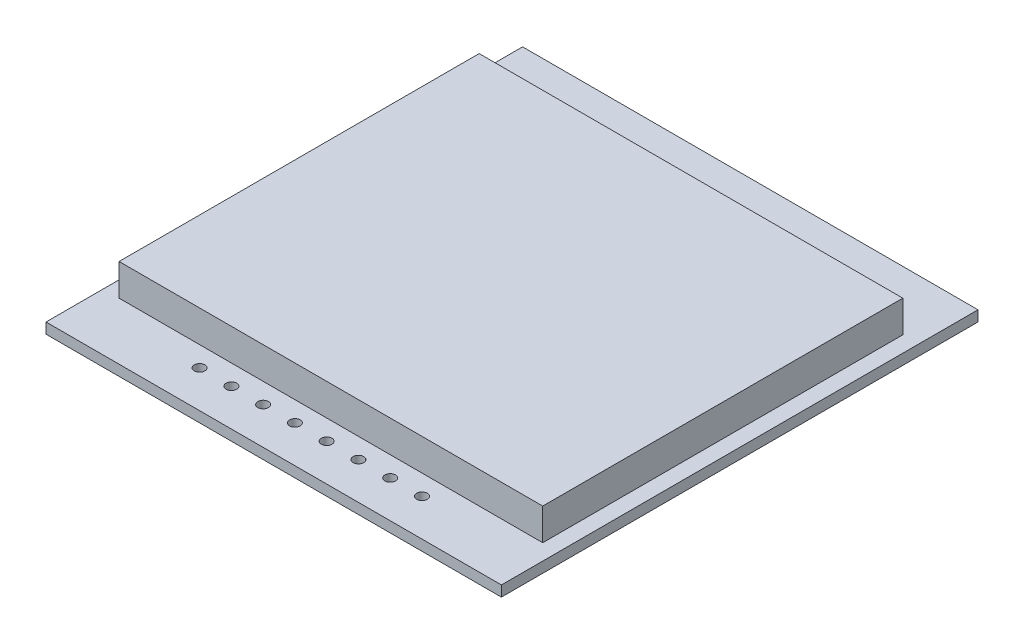
ISO-10303-21;
HEADER;
FILE_DESCRIPTION(('STEP AP214'),'2;1');
FILE_NAME('part.step','',(''),(''),'','','');
FILE_SCHEMA(('AUTOMOTIVE_DESIGN { 1 0 10303 214 1 1 1 1 }'));
ENDSEC;
DATA;
#1=APPLICATION_CONTEXT('core data for automotive mechanical design processes');
#2=APPLICATION_PROTOCOL_DEFINITION('international standard','automotive_design',2000,#1);
#3=PRODUCT_CONTEXT('',#1,'mechanical');
#4=PRODUCT('Part','Part','',(#3));
#5=PRODUCT_RELATED_PRODUCT_CATEGORY('part','',(#4));
#6=PRODUCT_DEFINITION_FORMATION('','',#4);
#7=PRODUCT_DEFINITION_CONTEXT('part definition',#1,'design');
#8=PRODUCT_DEFINITION('design','',#6,#7);
#9=PRODUCT_DEFINITION_SHAPE('','',#8);
#10=(LENGTH_UNIT() NAMED_UNIT(*) SI_UNIT(.MILLI.,.METRE.));
#11=(NAMED_UNIT(*) PLANE_ANGLE_UNIT() SI_UNIT($,.RADIAN.));
#12=(NAMED_UNIT(*) SI_UNIT($,.STERADIAN.) SOLID_ANGLE_UNIT());
#13=UNCERTAINTY_MEASURE_WITH_UNIT(LENGTH_MEASURE(1.E-05),#10,'distance_accuracy_value','');
#14=(GEOMETRIC_REPRESENTATION_CONTEXT(3) GLOBAL_UNCERTAINTY_ASSIGNED_CONTEXT((#13)) GLOBAL_UNIT_ASSIGNED_CONTEXT((#10,
#11,#12)) REPRESENTATION_CONTEXT('',''));
#15=CARTESIAN_POINT('',(0.,0.,0.));
#16=DIRECTION('',(0.,0.,1.));
#17=DIRECTION('',(1.,0.,0.));
#18=AXIS2_PLACEMENT_3D('',#15,#16,#17);
#19=CARTESIAN_POINT('',(0.,1.,0.));
#20=DIRECTION('',(0.,-1.,0.));
#21=DIRECTION('',(0.,0.,-1.));
#22=AXIS2_PLACEMENT_3D('',#19,#20,#21);
#23=PLANE('',#22);
#24=CARTESIAN_POINT('',(-1.5,1.,19.));
#25=DIRECTION('',(0.,1.,0.));
#26=DIRECTION('',(0.,0.,-1.));
#27=AXIS2_PLACEMENT_3D('',#24,#25,#26);
#28=CIRCLE('',#27,0.500000000000001);
#29=CARTESIAN_POINT('',(-1.5,1.,18.5));
#30=VERTEX_POINT('',#29);
#31=EDGE_CURVE('E346',#30,#30,#28,.T.);
#32=ORIENTED_EDGE('',*,*,#31,.F.);
#33=EDGE_LOOP('',(#32));
#34=FACE_BOUND('',#33,.T.);
#35=CARTESIAN_POINT('',(-4.5,1.,19.));
#36=DIRECTION('',(0.,1.,0.));
#37=DIRECTION('',(0.,0.,-1.));
#38=AXIS2_PLACEMENT_3D('',#35,#36,#37);
#39=CIRCLE('',#38,0.5);
#40=CARTESIAN_POINT('',(-4.5,1.,18.5));
#41=VERTEX_POINT('',#40);
#42=EDGE_CURVE('E348',#41,#41,#39,.T.);
#43=ORIENTED_EDGE('',*,*,#42,.F.);
#44=EDGE_LOOP('',(#43));
#45=FACE_BOUND('',#44,.T.);
#46=CARTESIAN_POINT('',(-7.5,1.,19.));
#47=DIRECTION('',(0.,1.,0.));
#48=DIRECTION('',(0.,0.,-1.));
#49=AXIS2_PLACEMENT_3D('',#46,#47,#48);
#50=CIRCLE('',#49,0.500000000000001);
#51=CARTESIAN_POINT('',(-7.5,1.,18.5));
#52=VERTEX_POINT('',#51);
#53=EDGE_CURVE('E354',#52,#52,#50,.T.);
#54=ORIENTED_EDGE('',*,*,#53,.F.);
#55=EDGE_LOOP('',(#54));
#56=FACE_BOUND('',#55,.T.);
#57=CARTESIAN_POINT('',(10.5,1.,19.));
#58=DIRECTION('',(0.,1.,0.));
#59=DIRECTION('',(0.,0.,1.));
#60=AXIS2_PLACEMENT_3D('',#57,#58,#59);
#61=CIRCLE('',#60,0.500000000000001);
#62=CARTESIAN_POINT('',(10.5,1.,19.5));
#63=VERTEX_POINT('',#62);
#64=EDGE_CURVE('E360',#63,#63,#61,.T.);
#65=ORIENTED_EDGE('',*,*,#64,.F.);
#66=EDGE_LOOP('',(#65));
#67=FACE_BOUND('',#66,.T.);
#68=CARTESIAN_POINT('',(7.5,1.,19.));
#69=DIRECTION('',(0.,1.,0.));
#70=DIRECTION('',(0.,0.,1.));
#71=AXIS2_PLACEMENT_3D('',#68,#69,#70);
#72=CIRCLE('',#71,0.500000000000001);
#73=CARTESIAN_POINT('',(7.5,1.,19.5));
#74=VERTEX_POINT('',#73);
#75=EDGE_CURVE('E366',#74,#74,#72,.T.);
#76=ORIENTED_EDGE('',*,*,#75,.F.);
#77=EDGE_LOOP('',(#76));
#78=FACE_BOUND('',#77,.T.);
#79=CARTESIAN_POINT('',(4.5,1.,19.));
#80=DIRECTION('',(0.,1.,0.));
#81=DIRECTION('',(0.,0.,1.));
#82=AXIS2_PLACEMENT_3D('',#79,#80,#81);
#83=CIRCLE('',#82,0.5);
#84=CARTESIAN_POINT('',(4.5,1.,19.5));
#85=VERTEX_POINT('',#84);
#86=EDGE_CURVE('E372',#85,#85,#83,.T.);
#87=ORIENTED_EDGE('',*,*,#86,.F.);
#88=EDGE_LOOP('',(#87));
#89=FACE_BOUND('',#88,.T.);
#90=CARTESIAN_POINT('',(-10.5,1.,19.));
#91=DIRECTION('',(0.,1.,0.));
#92=DIRECTION('',(0.,0.,-1.));
#93=AXIS2_PLACEMENT_3D('',#90,#91,#92);
#94=CIRCLE('',#93,0.500000000000001);
#95=CARTESIAN_POINT('',(-10.5,1.,18.5));
#96=VERTEX_POINT('',#95);
#97=EDGE_CURVE('E378',#96,#96,#94,.T.);
#98=ORIENTED_EDGE('',*,*,#97,.F.);
#99=EDGE_LOOP('',(#98));
#100=FACE_BOUND('',#99,.T.);
#101=CARTESIAN_POINT('',(1.5,1.,19.));
#102=DIRECTION('',(0.,1.,0.));
#103=DIRECTION('',(0.,0.,1.));
#104=AXIS2_PLACEMENT_3D('',#101,#102,#103);
#105=CIRCLE('',#104,0.5);
#106=CARTESIAN_POINT('',(1.5,1.,19.5));
#107=VERTEX_POINT('',#106);
#108=EDGE_CURVE('E384',#107,#107,#105,.T.);
#109=ORIENTED_EDGE('',*,*,#108,.F.);
#110=EDGE_LOOP('',(#109));
#111=FACE_BOUND('',#110,.T.);
#112=DIRECTION('',(0.,0.,-1.));
#113=VECTOR('',#112,1.);
#114=CARTESIAN_POINT('',(21.5,1.,22.5));
#115=LINE('',#114,#113);
#116=CARTESIAN_POINT('',(21.5,1.,22.5));
#117=VERTEX_POINT('',#116);
#118=CARTESIAN_POINT('',(21.5,1.,-22.5));
#119=VERTEX_POINT('',#118);
#120=EDGE_CURVE('E127',#117,#119,#115,.T.);
#121=ORIENTED_EDGE('',*,*,#120,.T.);
#122=DIRECTION('',(-1.,0.,0.));
#123=VECTOR('',#122,1.);
#124=CARTESIAN_POINT('',(-21.5,1.,-22.5));
#125=LINE('',#124,#123);
#126=CARTESIAN_POINT('',(-21.5,1.,-22.5));
#127=VERTEX_POINT('',#126);
#128=EDGE_CURVE('E130',#119,#127,#125,.T.);
#129=ORIENTED_EDGE('',*,*,#128,.T.);
#130=DIRECTION('',(0.,0.,1.));
#131=VECTOR('',#130,1.);
#132=CARTESIAN_POINT('',(-21.5,1.,22.5));
#133=LINE('',#132,#131);
#134=CARTESIAN_POINT('',(-21.5,1.,22.5));
#135=VERTEX_POINT('',#134);
#136=EDGE_CURVE('E133',#127,#135,#133,.T.);
#137=ORIENTED_EDGE('',*,*,#136,.T.);
#138=DIRECTION('',(1.,0.,0.));
#139=VECTOR('',#138,1.);
#140=CARTESIAN_POINT('',(-21.5,1.,22.5));
#141=LINE('',#140,#139);
#142=EDGE_CURVE('E135',#135,#117,#141,.T.);
#143=ORIENTED_EDGE('',*,*,#142,.T.);
#144=EDGE_LOOP('',(#121,#129,#137,#143));
#145=FACE_BOUND('',#144,.T.);
#146=DIRECTION('',(0.,0.,-1.));
#147=VECTOR('',#146,1.);
#148=CARTESIAN_POINT('',(20.,1.,17.1));
#149=LINE('',#148,#147);
#150=CARTESIAN_POINT('',(20.,1.,17.1));
#151=VERTEX_POINT('',#150);
#152=CARTESIAN_POINT('',(20.,1.,-16.9));
#153=VERTEX_POINT('',#152);
#154=EDGE_CURVE('E117',#151,#153,#149,.T.);
#155=ORIENTED_EDGE('',*,*,#154,.F.);
#156=DIRECTION('',(1.,0.,0.));
#157=VECTOR('',#156,1.);
#158=CARTESIAN_POINT('',(-20.,1.,17.1));
#159=LINE('',#158,#157);
#160=CARTESIAN_POINT('',(-20.,1.,17.1));
#161=VERTEX_POINT('',#160);
#162=EDGE_CURVE('E114',#161,#151,#159,.T.);
#163=ORIENTED_EDGE('',*,*,#162,.F.);
#164=DIRECTION('',(0.,0.,1.));
#165=VECTOR('',#164,1.);
#166=CARTESIAN_POINT('',(-20.,1.,17.1));
#167=LINE('',#166,#165);
#168=CARTESIAN_POINT('',(-20.,1.,-16.9));
#169=VERTEX_POINT('',#168);
#170=EDGE_CURVE('E52',#169,#161,#167,.T.);
#171=ORIENTED_EDGE('',*,*,#170,.F.);
#172=DIRECTION('',(-1.,0.,0.));
#173=VECTOR('',#172,1.);
#174=CARTESIAN_POINT('',(-20.,1.,-16.9));
#175=LINE('',#174,#173);
#176=EDGE_CURVE('E47',#153,#169,#175,.T.);
#177=ORIENTED_EDGE('',*,*,#176,.F.);
#178=EDGE_LOOP('',(#155,#163,#171,#177));
#179=FACE_BOUND('',#178,.T.);
#180=ADVANCED_FACE('F32',(#34,#45,#56,#67,#78,#89,#100,#111,#145,#179),#23,.F.);
#181=CARTESIAN_POINT('',(21.5,1.,22.5));
#182=DIRECTION('',(-1.,0.,0.));
#183=DIRECTION('',(0.,0.,1.));
#184=AXIS2_PLACEMENT_3D('',#181,#182,#183);
#185=PLANE('',#184);
#186=DIRECTION('',(0.,0.,-1.));
#187=VECTOR('',#186,1.);
#188=CARTESIAN_POINT('',(21.5,0.,22.5));
#189=LINE('',#188,#187);
#190=CARTESIAN_POINT('',(21.5,0.,22.5));
#191=VERTEX_POINT('',#190);
#192=CARTESIAN_POINT('',(21.5,0.,-22.5));
#193=VERTEX_POINT('',#192);
#194=EDGE_CURVE('E118',#191,#193,#189,.T.);
#195=ORIENTED_EDGE('',*,*,#194,.T.);
#196=DIRECTION('',(0.,-1.,0.));
#197=VECTOR('',#196,1.);
#198=CARTESIAN_POINT('',(21.5,1.,-22.5));
#199=LINE('',#198,#197);
#200=EDGE_CURVE('E11',#119,#193,#199,.T.);
#201=ORIENTED_EDGE('',*,*,#200,.F.);
#202=ORIENTED_EDGE('',*,*,#120,.F.);
#203=DIRECTION('',(0.,-1.,0.));
#204=VECTOR('',#203,1.);
#205=CARTESIAN_POINT('',(21.5,1.,22.5));
#206=LINE('',#205,#204);
#207=EDGE_CURVE('E136',#117,#191,#206,.T.);
#208=ORIENTED_EDGE('',*,*,#207,.T.);
#209=EDGE_LOOP('',(#195,#201,#202,#208));
#210=FACE_BOUND('',#209,.T.);
#211=ADVANCED_FACE('F34',(#210),#185,.F.);
#212=CARTESIAN_POINT('',(-21.5,1.,-22.5));
#213=DIRECTION('',(0.,0.,1.));
#214=DIRECTION('',(1.,0.,0.));
#215=AXIS2_PLACEMENT_3D('',#212,#213,#214);
#216=PLANE('',#215);
#217=DIRECTION('',(-1.,0.,0.));
#218=VECTOR('',#217,1.);
#219=CARTESIAN_POINT('',(-21.5,0.,-22.5));
#220=LINE('',#219,#218);
#221=CARTESIAN_POINT('',(-21.5,0.,-22.5));
#222=VERTEX_POINT('',#221);
#223=EDGE_CURVE('E121',#193,#222,#220,.T.);
#224=ORIENTED_EDGE('',*,*,#223,.T.);
#225=DIRECTION('',(0.,-1.,0.));
#226=VECTOR('',#225,1.);
#227=CARTESIAN_POINT('',(-21.5,1.,-22.5));
#228=LINE('',#227,#226);
#229=EDGE_CURVE('E40',#127,#222,#228,.T.);
#230=ORIENTED_EDGE('',*,*,#229,.F.);
#231=ORIENTED_EDGE('',*,*,#128,.F.);
#232=ORIENTED_EDGE('',*,*,#200,.T.);
#233=EDGE_LOOP('',(#224,#230,#231,#232));
#234=FACE_BOUND('',#233,.T.);
#235=ADVANCED_FACE('F166',(#234),#216,.F.);
#236=CARTESIAN_POINT('',(-21.5,1.,22.5));
#237=DIRECTION('',(1.,0.,0.));
#238=DIRECTION('',(0.,0.,-1.));
#239=AXIS2_PLACEMENT_3D('',#236,#237,#238);
#240=PLANE('',#239);
#241=DIRECTION('',(0.,0.,1.));
#242=VECTOR('',#241,1.);
#243=CARTESIAN_POINT('',(-21.5,0.,22.5));
#244=LINE('',#243,#242);
#245=CARTESIAN_POINT('',(-21.5,0.,22.5));
#246=VERTEX_POINT('',#245);
#247=EDGE_CURVE('E139',#222,#246,#244,.T.);
#248=ORIENTED_EDGE('',*,*,#247,.T.);
#249=DIRECTION('',(0.,-1.,0.));
#250=VECTOR('',#249,1.);
#251=CARTESIAN_POINT('',(-21.5,1.,22.5));
#252=LINE('',#251,#250);
#253=EDGE_CURVE('E144',#135,#246,#252,.T.);
#254=ORIENTED_EDGE('',*,*,#253,.F.);
#255=ORIENTED_EDGE('',*,*,#136,.F.);
#256=ORIENTED_EDGE('',*,*,#229,.T.);
#257=EDGE_LOOP('',(#248,#254,#255,#256));
#258=FACE_BOUND('',#257,.T.);
#259=ADVANCED_FACE('F151',(#258),#240,.F.);
#260=CARTESIAN_POINT('',(-21.5,1.,22.5));
#261=DIRECTION('',(0.,0.,-1.));
#262=DIRECTION('',(-1.,0.,0.));
#263=AXIS2_PLACEMENT_3D('',#260,#261,#262);
#264=PLANE('',#263);
#265=DIRECTION('',(1.,0.,0.));
#266=VECTOR('',#265,1.);
#267=CARTESIAN_POINT('',(-21.5,0.,22.5));
#268=LINE('',#267,#266);
#269=EDGE_CURVE('E131',#246,#191,#268,.T.);
#270=ORIENTED_EDGE('',*,*,#269,.T.);
#271=ORIENTED_EDGE('',*,*,#207,.F.);
#272=ORIENTED_EDGE('',*,*,#142,.F.);
#273=ORIENTED_EDGE('',*,*,#253,.T.);
#274=EDGE_LOOP('',(#270,#271,#272,#273));
#275=FACE_BOUND('',#274,.T.);
#276=ADVANCED_FACE('F160',(#275),#264,.F.);
#277=CARTESIAN_POINT('',(0.,0.,0.));
#278=DIRECTION('',(0.,-1.,0.));
#279=DIRECTION('',(0.,0.,-1.));
#280=AXIS2_PLACEMENT_3D('',#277,#278,#279);
#281=PLANE('',#280);
#282=CARTESIAN_POINT('',(-1.5,0.,19.));
#283=DIRECTION('',(0.,1.,0.));
#284=DIRECTION('',(0.,0.,-1.));
#285=AXIS2_PLACEMENT_3D('',#282,#283,#284);
#286=CIRCLE('',#285,0.500000000000001);
#287=CARTESIAN_POINT('',(-1.5,0.,18.5));
#288=VERTEX_POINT('',#287);
#289=EDGE_CURVE('E344',#288,#288,#286,.T.);
#290=ORIENTED_EDGE('',*,*,#289,.T.);
#291=EDGE_LOOP('',(#290));
#292=FACE_BOUND('',#291,.T.);
#293=CARTESIAN_POINT('',(-4.5,0.,19.));
#294=DIRECTION('',(0.,1.,0.));
#295=DIRECTION('',(0.,0.,-1.));
#296=AXIS2_PLACEMENT_3D('',#293,#294,#295);
#297=CIRCLE('',#296,0.5);
#298=CARTESIAN_POINT('',(-4.5,0.,18.5));
#299=VERTEX_POINT('',#298);
#300=EDGE_CURVE('E351',#299,#299,#297,.T.);
#301=ORIENTED_EDGE('',*,*,#300,.T.);
#302=EDGE_LOOP('',(#301));
#303=FACE_BOUND('',#302,.T.);
#304=CARTESIAN_POINT('',(-7.5,0.,19.));
#305=DIRECTION('',(0.,1.,0.));
#306=DIRECTION('',(0.,0.,-1.));
#307=AXIS2_PLACEMENT_3D('',#304,#305,#306);
#308=CIRCLE('',#307,0.500000000000001);
#309=CARTESIAN_POINT('',(-7.5,0.,18.5));
#310=VERTEX_POINT('',#309);
#311=EDGE_CURVE('E357',#310,#310,#308,.T.);
#312=ORIENTED_EDGE('',*,*,#311,.T.);
#313=EDGE_LOOP('',(#312));
#314=FACE_BOUND('',#313,.T.);
#315=CARTESIAN_POINT('',(10.5,0.,19.));
#316=DIRECTION('',(0.,1.,0.));
#317=DIRECTION('',(0.,0.,1.));
#318=AXIS2_PLACEMENT_3D('',#315,#316,#317);
#319=CIRCLE('',#318,0.500000000000001);
#320=CARTESIAN_POINT('',(10.5,0.,19.5));
#321=VERTEX_POINT('',#320);
#322=EDGE_CURVE('E363',#321,#321,#319,.T.);
#323=ORIENTED_EDGE('',*,*,#322,.T.);
#324=EDGE_LOOP('',(#323));
#325=FACE_BOUND('',#324,.T.);
#326=CARTESIAN_POINT('',(7.5,0.,19.));
#327=DIRECTION('',(0.,1.,0.));
#328=DIRECTION('',(0.,0.,1.));
#329=AXIS2_PLACEMENT_3D('',#326,#327,#328);
#330=CIRCLE('',#329,0.500000000000001);
#331=CARTESIAN_POINT('',(7.5,0.,19.5));
#332=VERTEX_POINT('',#331);
#333=EDGE_CURVE('E369',#332,#332,#330,.T.);
#334=ORIENTED_EDGE('',*,*,#333,.T.);
#335=EDGE_LOOP('',(#334));
#336=FACE_BOUND('',#335,.T.);
#337=CARTESIAN_POINT('',(4.5,0.,19.));
#338=DIRECTION('',(0.,1.,0.));
#339=DIRECTION('',(0.,0.,1.));
#340=AXIS2_PLACEMENT_3D('',#337,#338,#339);
#341=CIRCLE('',#340,0.5);
#342=CARTESIAN_POINT('',(4.5,0.,19.5));
#343=VERTEX_POINT('',#342);
#344=EDGE_CURVE('E375',#343,#343,#341,.T.);
#345=ORIENTED_EDGE('',*,*,#344,.T.);
#346=EDGE_LOOP('',(#345));
#347=FACE_BOUND('',#346,.T.);
#348=CARTESIAN_POINT('',(-10.5,0.,19.));
#349=DIRECTION('',(0.,1.,0.));
#350=DIRECTION('',(0.,0.,-1.));
#351=AXIS2_PLACEMENT_3D('',#348,#349,#350);
#352=CIRCLE('',#351,0.500000000000001);
#353=CARTESIAN_POINT('',(-10.5,0.,18.5));
#354=VERTEX_POINT('',#353);
#355=EDGE_CURVE('E381',#354,#354,#352,.T.);
#356=ORIENTED_EDGE('',*,*,#355,.T.);
#357=EDGE_LOOP('',(#356));
#358=FACE_BOUND('',#357,.T.);
#359=CARTESIAN_POINT('',(1.5,0.,19.));
#360=DIRECTION('',(0.,1.,0.));
#361=DIRECTION('',(0.,0.,1.));
#362=AXIS2_PLACEMENT_3D('',#359,#360,#361);
#363=CIRCLE('',#362,0.5);
#364=CARTESIAN_POINT('',(1.5,0.,19.5));
#365=VERTEX_POINT('',#364);
#366=EDGE_CURVE('E387',#365,#365,#363,.T.);
#367=ORIENTED_EDGE('',*,*,#366,.T.);
#368=EDGE_LOOP('',(#367));
#369=FACE_BOUND('',#368,.T.);
#370=ORIENTED_EDGE('',*,*,#194,.F.);
#371=ORIENTED_EDGE('',*,*,#269,.F.);
#372=ORIENTED_EDGE('',*,*,#247,.F.);
#373=ORIENTED_EDGE('',*,*,#223,.F.);
#374=EDGE_LOOP('',(#370,#371,#372,#373));
#375=FACE_BOUND('',#374,.T.);
#376=ADVANCED_FACE('F157',(#292,#303,#314,#325,#336,#347,#358,#369,#375),#281,.T.);
#377=CARTESIAN_POINT('',(20.,4.,17.1));
#378=DIRECTION('',(-1.,0.,0.));
#379=DIRECTION('',(0.,0.,1.));
#380=AXIS2_PLACEMENT_3D('',#377,#378,#379);
#381=PLANE('',#380);
#382=ORIENTED_EDGE('',*,*,#154,.T.);
#383=DIRECTION('',(0.,-1.,0.));
#384=VECTOR('',#383,1.);
#385=CARTESIAN_POINT('',(20.,4.,-16.9));
#386=LINE('',#385,#384);
#387=CARTESIAN_POINT('',(20.,4.,-16.9));
#388=VERTEX_POINT('',#387);
#389=EDGE_CURVE('E98',#388,#153,#386,.T.);
#390=ORIENTED_EDGE('',*,*,#389,.F.);
#391=DIRECTION('',(0.,0.,-1.));
#392=VECTOR('',#391,1.);
#393=CARTESIAN_POINT('',(20.,4.,17.1));
#394=LINE('',#393,#392);
#395=CARTESIAN_POINT('',(20.,4.,17.1));
#396=VERTEX_POINT('',#395);
#397=EDGE_CURVE('E105',#396,#388,#394,.T.);
#398=ORIENTED_EDGE('',*,*,#397,.F.);
#399=DIRECTION('',(0.,-1.,0.));
#400=VECTOR('',#399,1.);
#401=CARTESIAN_POINT('',(20.,4.,17.1));
#402=LINE('',#401,#400);
#403=EDGE_CURVE('E394',#396,#151,#402,.T.);
#404=ORIENTED_EDGE('',*,*,#403,.T.);
#405=EDGE_LOOP('',(#382,#390,#398,#404));
#406=FACE_BOUND('',#405,.T.);
#407=ADVANCED_FACE('F116',(#406),#381,.F.);
#408=CARTESIAN_POINT('',(-20.,4.,-16.9));
#409=DIRECTION('',(0.,0.,1.));
#410=DIRECTION('',(1.,0.,0.));
#411=AXIS2_PLACEMENT_3D('',#408,#409,#410);
#412=PLANE('',#411);
#413=ORIENTED_EDGE('',*,*,#176,.T.);
#414=DIRECTION('',(0.,-1.,0.));
#415=VECTOR('',#414,1.);
#416=CARTESIAN_POINT('',(-20.,4.,-16.9));
#417=LINE('',#416,#415);
#418=CARTESIAN_POINT('',(-20.,4.,-16.9));
#419=VERTEX_POINT('',#418);
#420=EDGE_CURVE('E101',#419,#169,#417,.T.);
#421=ORIENTED_EDGE('',*,*,#420,.F.);
#422=DIRECTION('',(-1.,0.,0.));
#423=VECTOR('',#422,1.);
#424=CARTESIAN_POINT('',(-20.,4.,-16.9));
#425=LINE('',#424,#423);
#426=EDGE_CURVE('E94',#388,#419,#425,.T.);
#427=ORIENTED_EDGE('',*,*,#426,.F.);
#428=ORIENTED_EDGE('',*,*,#389,.T.);
#429=EDGE_LOOP('',(#413,#421,#427,#428));
#430=FACE_BOUND('',#429,.T.);
#431=ADVANCED_FACE('F96',(#430),#412,.F.);
#432=CARTESIAN_POINT('',(-20.,4.,17.1));
#433=DIRECTION('',(1.,0.,0.));
#434=DIRECTION('',(0.,0.,-1.));
#435=AXIS2_PLACEMENT_3D('',#432,#433,#434);
#436=PLANE('',#435);
#437=ORIENTED_EDGE('',*,*,#170,.T.);
#438=DIRECTION('',(0.,-1.,0.));
#439=VECTOR('',#438,1.);
#440=CARTESIAN_POINT('',(-20.,4.,17.1));
#441=LINE('',#440,#439);
#442=CARTESIAN_POINT('',(-20.,4.,17.1));
#443=VERTEX_POINT('',#442);
#444=EDGE_CURVE('E123',#443,#161,#441,.T.);
#445=ORIENTED_EDGE('',*,*,#444,.F.);
#446=DIRECTION('',(0.,0.,1.));
#447=VECTOR('',#446,1.);
#448=CARTESIAN_POINT('',(-20.,4.,17.1));
#449=LINE('',#448,#447);
#450=EDGE_CURVE('E104',#419,#443,#449,.T.);
#451=ORIENTED_EDGE('',*,*,#450,.F.);
#452=ORIENTED_EDGE('',*,*,#420,.T.);
#453=EDGE_LOOP('',(#437,#445,#451,#452));
#454=FACE_BOUND('',#453,.T.);
#455=ADVANCED_FACE('F207',(#454),#436,.F.);
#456=CARTESIAN_POINT('',(-20.,4.,17.1));
#457=DIRECTION('',(0.,0.,-1.));
#458=DIRECTION('',(-1.,0.,0.));
#459=AXIS2_PLACEMENT_3D('',#456,#457,#458);
#460=PLANE('',#459);
#461=ORIENTED_EDGE('',*,*,#162,.T.);
#462=ORIENTED_EDGE('',*,*,#403,.F.);
#463=DIRECTION('',(1.,0.,0.));
#464=VECTOR('',#463,1.);
#465=CARTESIAN_POINT('',(-20.,4.,17.1));
#466=LINE('',#465,#464);
#467=EDGE_CURVE('E110',#443,#396,#466,.T.);
#468=ORIENTED_EDGE('',*,*,#467,.F.);
#469=ORIENTED_EDGE('',*,*,#444,.T.);
#470=EDGE_LOOP('',(#461,#462,#468,#469));
#471=FACE_BOUND('',#470,.T.);
#472=ADVANCED_FACE('F213',(#471),#460,.F.);
#473=CARTESIAN_POINT('',(0.,4.,0.));
#474=DIRECTION('',(0.,-1.,0.));
#475=DIRECTION('',(0.,0.,-1.));
#476=AXIS2_PLACEMENT_3D('',#473,#474,#475);
#477=PLANE('',#476);
#478=ORIENTED_EDGE('',*,*,#397,.T.);
#479=ORIENTED_EDGE('',*,*,#426,.T.);
#480=ORIENTED_EDGE('',*,*,#450,.T.);
#481=ORIENTED_EDGE('',*,*,#467,.T.);
#482=EDGE_LOOP('',(#478,#479,#480,#481));
#483=FACE_BOUND('',#482,.T.);
#484=ADVANCED_FACE('F108',(#483),#477,.F.);
#485=CARTESIAN_POINT('',(1.5,0.,19.));
#486=DIRECTION('',(0.,1.,0.));
#487=DIRECTION('',(0.,0.,1.));
#488=AXIS2_PLACEMENT_3D('',#485,#486,#487);
#489=CYLINDRICAL_SURFACE('',#488,0.5);
#490=ORIENTED_EDGE('',*,*,#366,.F.);
#491=EDGE_LOOP('',(#490));
#492=FACE_BOUND('',#491,.T.);
#493=ORIENTED_EDGE('',*,*,#108,.T.);
#494=EDGE_LOOP('',(#493));
#495=FACE_BOUND('',#494,.T.);
#496=ADVANCED_FACE('F228',(#492,#495),#489,.F.);
#497=CARTESIAN_POINT('',(-10.5,0.,19.));
#498=DIRECTION('',(0.,1.,0.));
#499=DIRECTION('',(0.,0.,1.));
#500=AXIS2_PLACEMENT_3D('',#497,#498,#499);
#501=CYLINDRICAL_SURFACE('',#500,0.500000000000001);
#502=ORIENTED_EDGE('',*,*,#355,.F.);
#503=EDGE_LOOP('',(#502));
#504=FACE_BOUND('',#503,.T.);
#505=ORIENTED_EDGE('',*,*,#97,.T.);
#506=EDGE_LOOP('',(#505));
#507=FACE_BOUND('',#506,.T.);
#508=ADVANCED_FACE('F234',(#504,#507),#501,.F.);
#509=CARTESIAN_POINT('',(4.5,0.,19.));
#510=DIRECTION('',(0.,1.,0.));
#511=DIRECTION('',(0.,0.,1.));
#512=AXIS2_PLACEMENT_3D('',#509,#510,#511);
#513=CYLINDRICAL_SURFACE('',#512,0.5);
#514=ORIENTED_EDGE('',*,*,#344,.F.);
#515=EDGE_LOOP('',(#514));
#516=FACE_BOUND('',#515,.T.);
#517=ORIENTED_EDGE('',*,*,#86,.T.);
#518=EDGE_LOOP('',(#517));
#519=FACE_BOUND('',#518,.T.);
#520=ADVANCED_FACE('F242',(#516,#519),#513,.F.);
#521=CARTESIAN_POINT('',(7.5,0.,19.));
#522=DIRECTION('',(0.,1.,0.));
#523=DIRECTION('',(0.,0.,1.));
#524=AXIS2_PLACEMENT_3D('',#521,#522,#523);
#525=CYLINDRICAL_SURFACE('',#524,0.500000000000001);
#526=ORIENTED_EDGE('',*,*,#333,.F.);
#527=EDGE_LOOP('',(#526));
#528=FACE_BOUND('',#527,.T.);
#529=ORIENTED_EDGE('',*,*,#75,.T.);
#530=EDGE_LOOP('',(#529));
#531=FACE_BOUND('',#530,.T.);
#532=ADVANCED_FACE('F250',(#528,#531),#525,.F.);
#533=CARTESIAN_POINT('',(10.5,0.,19.));
#534=DIRECTION('',(0.,1.,0.));
#535=DIRECTION('',(0.,0.,1.));
#536=AXIS2_PLACEMENT_3D('',#533,#534,#535);
#537=CYLINDRICAL_SURFACE('',#536,0.500000000000001);
#538=ORIENTED_EDGE('',*,*,#322,.F.);
#539=EDGE_LOOP('',(#538));
#540=FACE_BOUND('',#539,.T.);
#541=ORIENTED_EDGE('',*,*,#64,.T.);
#542=EDGE_LOOP('',(#541));
#543=FACE_BOUND('',#542,.T.);
#544=ADVANCED_FACE('F258',(#540,#543),#537,.F.);
#545=CARTESIAN_POINT('',(-7.5,0.,19.));
#546=DIRECTION('',(0.,1.,0.));
#547=DIRECTION('',(0.,0.,1.));
#548=AXIS2_PLACEMENT_3D('',#545,#546,#547);
#549=CYLINDRICAL_SURFACE('',#548,0.500000000000001);
#550=ORIENTED_EDGE('',*,*,#311,.F.);
#551=EDGE_LOOP('',(#550));
#552=FACE_BOUND('',#551,.T.);
#553=ORIENTED_EDGE('',*,*,#53,.T.);
#554=EDGE_LOOP('',(#553));
#555=FACE_BOUND('',#554,.T.);
#556=ADVANCED_FACE('F266',(#552,#555),#549,.F.);
#557=CARTESIAN_POINT('',(-4.5,0.,19.));
#558=DIRECTION('',(0.,1.,0.));
#559=DIRECTION('',(0.,0.,1.));
#560=AXIS2_PLACEMENT_3D('',#557,#558,#559);
#561=CYLINDRICAL_SURFACE('',#560,0.5);
#562=ORIENTED_EDGE('',*,*,#300,.F.);
#563=EDGE_LOOP('',(#562));
#564=FACE_BOUND('',#563,.T.);
#565=ORIENTED_EDGE('',*,*,#42,.T.);
#566=EDGE_LOOP('',(#565));
#567=FACE_BOUND('',#566,.T.);
#568=ADVANCED_FACE('F274',(#564,#567),#561,.F.);
#569=CARTESIAN_POINT('',(-1.5,0.,19.));
#570=DIRECTION('',(0.,1.,0.));
#571=DIRECTION('',(0.,0.,1.));
#572=AXIS2_PLACEMENT_3D('',#569,#570,#571);
#573=CYLINDRICAL_SURFACE('',#572,0.500000000000001);
#574=ORIENTED_EDGE('',*,*,#289,.F.);
#575=EDGE_LOOP('',(#574));
#576=FACE_BOUND('',#575,.T.);
#577=ORIENTED_EDGE('',*,*,#31,.T.);
#578=EDGE_LOOP('',(#577));
#579=FACE_BOUND('',#578,.T.);
#580=ADVANCED_FACE('F282',(#576,#579),#573,.F.);
#581=CLOSED_SHELL('',(#180,#211,#235,#259,#276,#376,#407,#431,#455,#472,#484,#496,#508,#520,
#532,#544,#556,#568,#580));
#582=MANIFOLD_SOLID_BREP('B2',#581);
#583=ADVANCED_BREP_SHAPE_REPRESENTATION('',(#18,#582),#14);
#584=SHAPE_DEFINITION_REPRESENTATION(#9,#583);
ENDSEC;
END-ISO-10303-21;
